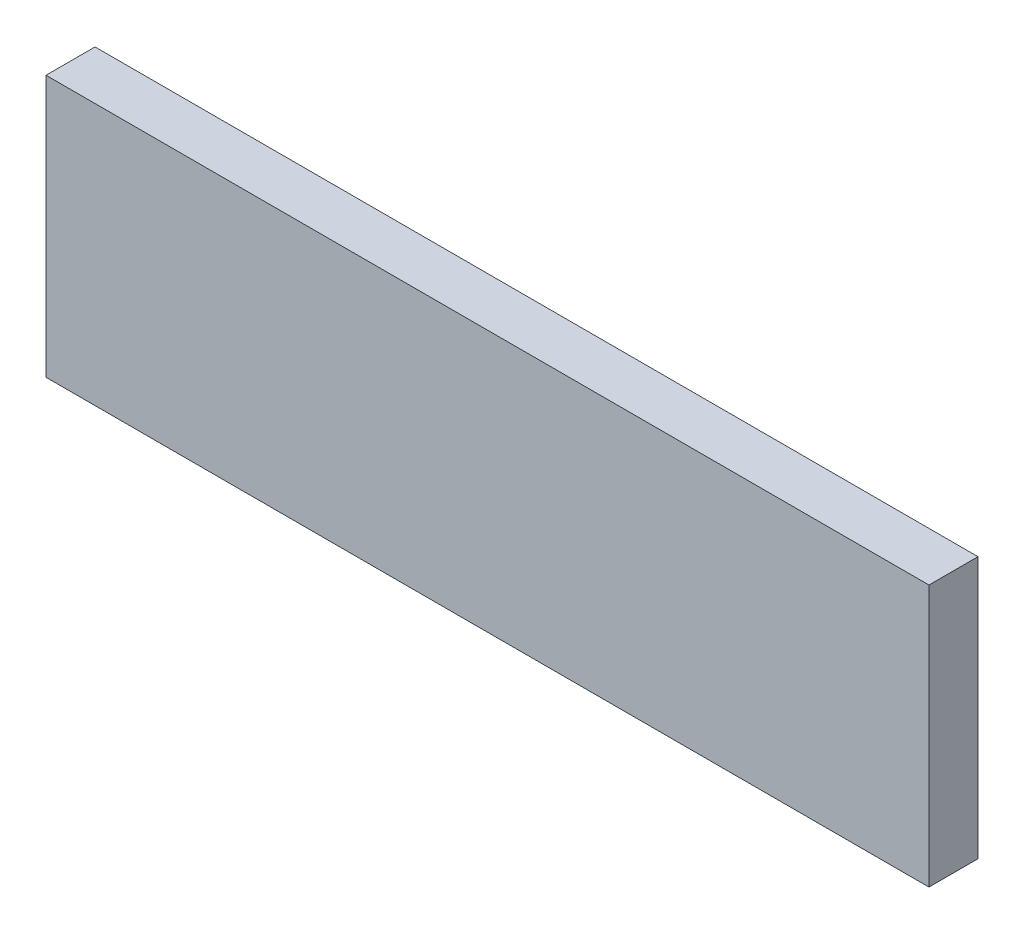
ISO-10303-21;
HEADER;
FILE_DESCRIPTION(('STEP AP214'),'2;1');
FILE_NAME('part.step','',(''),(''),'','','');
FILE_SCHEMA(('AUTOMOTIVE_DESIGN { 1 0 10303 214 1 1 1 1 }'));
ENDSEC;
DATA;
#1=APPLICATION_CONTEXT('core data for automotive mechanical design processes');
#2=APPLICATION_PROTOCOL_DEFINITION('international standard','automotive_design',2000,#1);
#3=PRODUCT_CONTEXT('',#1,'mechanical');
#4=PRODUCT('Part','Part','',(#3));
#5=PRODUCT_RELATED_PRODUCT_CATEGORY('part','',(#4));
#6=PRODUCT_DEFINITION_FORMATION('','',#4);
#7=PRODUCT_DEFINITION_CONTEXT('part definition',#1,'design');
#8=PRODUCT_DEFINITION('design','',#6,#7);
#9=PRODUCT_DEFINITION_SHAPE('','',#8);
#10=(LENGTH_UNIT() NAMED_UNIT(*) SI_UNIT(.MILLI.,.METRE.));
#11=(NAMED_UNIT(*) PLANE_ANGLE_UNIT() SI_UNIT($,.RADIAN.));
#12=(NAMED_UNIT(*) SI_UNIT($,.STERADIAN.) SOLID_ANGLE_UNIT());
#13=UNCERTAINTY_MEASURE_WITH_UNIT(LENGTH_MEASURE(1.E-05),#10,'distance_accuracy_value','');
#14=(GEOMETRIC_REPRESENTATION_CONTEXT(3) GLOBAL_UNCERTAINTY_ASSIGNED_CONTEXT((#13)) GLOBAL_UNIT_ASSIGNED_CONTEXT((#10,
#11,#12)) REPRESENTATION_CONTEXT('',''));
#15=CARTESIAN_POINT('',(0.,0.,0.));
#16=DIRECTION('',(0.,0.,1.));
#17=DIRECTION('',(1.,0.,0.));
#18=AXIS2_PLACEMENT_3D('',#15,#16,#17);
#19=CARTESIAN_POINT('',(-1.34999984,0.40000174,0.15));
#20=DIRECTION('',(0.,0.,1.));
#21=DIRECTION('',(1.,0.,0.));
#22=AXIS2_PLACEMENT_3D('',#19,#20,#21);
#23=PLANE('',#22);
#24=DIRECTION('',(0.,1.,0.));
#25=VECTOR('',#24,1.);
#26=CARTESIAN_POINT('',(1.34999984,0.40000174,0.15));
#27=LINE('',#26,#25);
#28=CARTESIAN_POINT('',(1.34999984,0.40000174,0.15));
#29=VERTEX_POINT('',#28);
#30=CARTESIAN_POINT('',(1.34999984,-0.3999992,0.15));
#31=VERTEX_POINT('',#30);
#32=EDGE_CURVE('E53',#29,#31,#27,.F.);
#33=ORIENTED_EDGE('',*,*,#32,.F.);
#34=DIRECTION('',(1.,0.,0.));
#35=VECTOR('',#34,1.);
#36=CARTESIAN_POINT('',(-1.34999984,0.40000174,0.15));
#37=LINE('',#36,#35);
#38=CARTESIAN_POINT('',(-1.34999984,0.40000174,0.15));
#39=VERTEX_POINT('',#38);
#40=EDGE_CURVE('E69',#39,#29,#37,.T.);
#41=ORIENTED_EDGE('',*,*,#40,.F.);
#42=DIRECTION('',(0.,1.,0.));
#43=VECTOR('',#42,1.);
#44=CARTESIAN_POINT('',(-1.34999984,-0.3999992,0.15));
#45=LINE('',#44,#43);
#46=CARTESIAN_POINT('',(-1.34999984,-0.3999992,0.15));
#47=VERTEX_POINT('',#46);
#48=EDGE_CURVE('E19',#47,#39,#45,.T.);
#49=ORIENTED_EDGE('',*,*,#48,.F.);
#50=DIRECTION('',(1.,0.,0.));
#51=VECTOR('',#50,1.);
#52=CARTESIAN_POINT('',(1.34999984,-0.3999992,0.15));
#53=LINE('',#52,#51);
#54=EDGE_CURVE('E58',#31,#47,#53,.F.);
#55=ORIENTED_EDGE('',*,*,#54,.F.);
#56=EDGE_LOOP('',(#33,#41,#49,#55));
#57=FACE_BOUND('',#56,.T.);
#58=ADVANCED_FACE('F16',(#57),#23,.T.);
#59=CARTESIAN_POINT('',(-1.34999984,-0.3999992,0.));
#60=DIRECTION('',(-1.,0.,0.));
#61=DIRECTION('',(0.,0.,1.));
#62=AXIS2_PLACEMENT_3D('',#59,#60,#61);
#63=PLANE('',#62);
#64=DIRECTION('',(0.,0.,1.));
#65=VECTOR('',#64,1.);
#66=CARTESIAN_POINT('',(-1.34999984,0.40000174,0.));
#67=LINE('',#66,#65);
#68=CARTESIAN_POINT('',(-1.34999984,0.40000174,0.));
#69=VERTEX_POINT('',#68);
#70=EDGE_CURVE('E88',#69,#39,#67,.T.);
#71=ORIENTED_EDGE('',*,*,#70,.F.);
#72=DIRECTION('',(0.,1.,0.));
#73=VECTOR('',#72,1.);
#74=CARTESIAN_POINT('',(-1.34999984,0.40000174,0.));
#75=LINE('',#74,#73);
#76=CARTESIAN_POINT('',(-1.34999984,-0.3999992,0.));
#77=VERTEX_POINT('',#76);
#78=EDGE_CURVE('E76',#69,#77,#75,.F.);
#79=ORIENTED_EDGE('',*,*,#78,.T.);
#80=DIRECTION('',(0.,0.,-1.));
#81=VECTOR('',#80,1.);
#82=CARTESIAN_POINT('',(-1.34999984,-0.3999992,0.));
#83=LINE('',#82,#81);
#84=EDGE_CURVE('E63',#47,#77,#83,.T.);
#85=ORIENTED_EDGE('',*,*,#84,.F.);
#86=ORIENTED_EDGE('',*,*,#48,.T.);
#87=EDGE_LOOP('',(#71,#79,#85,#86));
#88=FACE_BOUND('',#87,.T.);
#89=ADVANCED_FACE('F75',(#88),#63,.T.);
#90=CARTESIAN_POINT('',(1.34999984,-0.3999992,0.));
#91=DIRECTION('',(0.,-1.,0.));
#92=DIRECTION('',(0.,0.,-1.));
#93=AXIS2_PLACEMENT_3D('',#90,#91,#92);
#94=PLANE('',#93);
#95=ORIENTED_EDGE('',*,*,#84,.T.);
#96=DIRECTION('',(1.,0.,0.));
#97=VECTOR('',#96,1.);
#98=CARTESIAN_POINT('',(-1.34999984,-0.3999992,0.));
#99=LINE('',#98,#97);
#100=CARTESIAN_POINT('',(1.34999984,-0.3999992,0.));
#101=VERTEX_POINT('',#100);
#102=EDGE_CURVE('E96',#77,#101,#99,.T.);
#103=ORIENTED_EDGE('',*,*,#102,.T.);
#104=DIRECTION('',(0.,0.,-1.));
#105=VECTOR('',#104,1.);
#106=CARTESIAN_POINT('',(1.34999984,-0.3999992,0.));
#107=LINE('',#106,#105);
#108=EDGE_CURVE('E65',#31,#101,#107,.T.);
#109=ORIENTED_EDGE('',*,*,#108,.F.);
#110=ORIENTED_EDGE('',*,*,#54,.T.);
#111=EDGE_LOOP('',(#95,#103,#109,#110));
#112=FACE_BOUND('',#111,.T.);
#113=ADVANCED_FACE('F60',(#112),#94,.T.);
#114=CARTESIAN_POINT('',(1.34999984,0.40000174,0.));
#115=DIRECTION('',(1.,0.,0.));
#116=DIRECTION('',(0.,0.,-1.));
#117=AXIS2_PLACEMENT_3D('',#114,#115,#116);
#118=PLANE('',#117);
#119=ORIENTED_EDGE('',*,*,#108,.T.);
#120=DIRECTION('',(0.,1.,0.));
#121=VECTOR('',#120,1.);
#122=CARTESIAN_POINT('',(1.34999984,0.40000174,0.));
#123=LINE('',#122,#121);
#124=CARTESIAN_POINT('',(1.34999984,0.40000174,0.));
#125=VERTEX_POINT('',#124);
#126=EDGE_CURVE('E26',#101,#125,#123,.T.);
#127=ORIENTED_EDGE('',*,*,#126,.T.);
#128=DIRECTION('',(0.,0.,1.));
#129=VECTOR('',#128,1.);
#130=CARTESIAN_POINT('',(1.34999984,0.40000174,0.));
#131=LINE('',#130,#129);
#132=EDGE_CURVE('E34',#29,#125,#131,.F.);
#133=ORIENTED_EDGE('',*,*,#132,.F.);
#134=ORIENTED_EDGE('',*,*,#32,.T.);
#135=EDGE_LOOP('',(#119,#127,#133,#134));
#136=FACE_BOUND('',#135,.T.);
#137=ADVANCED_FACE('F102',(#136),#118,.T.);
#138=CARTESIAN_POINT('',(-1.34999984,0.40000174,0.));
#139=DIRECTION('',(0.,1.,0.));
#140=DIRECTION('',(0.,0.,1.));
#141=AXIS2_PLACEMENT_3D('',#138,#139,#140);
#142=PLANE('',#141);
#143=ORIENTED_EDGE('',*,*,#132,.T.);
#144=DIRECTION('',(1.,0.,0.));
#145=VECTOR('',#144,1.);
#146=CARTESIAN_POINT('',(-1.34999984,0.40000174,0.));
#147=LINE('',#146,#145);
#148=EDGE_CURVE('E11',#125,#69,#147,.F.);
#149=ORIENTED_EDGE('',*,*,#148,.T.);
#150=ORIENTED_EDGE('',*,*,#70,.T.);
#151=ORIENTED_EDGE('',*,*,#40,.T.);
#152=EDGE_LOOP('',(#143,#149,#150,#151));
#153=FACE_BOUND('',#152,.T.);
#154=ADVANCED_FACE('F105',(#153),#142,.T.);
#155=CARTESIAN_POINT('',(-1.34999984,0.40000174,0.));
#156=DIRECTION('',(0.,0.,1.));
#157=DIRECTION('',(1.,0.,0.));
#158=AXIS2_PLACEMENT_3D('',#155,#156,#157);
#159=PLANE('',#158);
#160=ORIENTED_EDGE('',*,*,#126,.F.);
#161=ORIENTED_EDGE('',*,*,#102,.F.);
#162=ORIENTED_EDGE('',*,*,#78,.F.);
#163=ORIENTED_EDGE('',*,*,#148,.F.);
#164=EDGE_LOOP('',(#160,#161,#162,#163));
#165=FACE_BOUND('',#164,.T.);
#166=ADVANCED_FACE('F104',(#165),#159,.F.);
#167=CLOSED_SHELL('',(#58,#89,#113,#137,#154,#166));
#168=MANIFOLD_SOLID_BREP('B1',#167);
#169=ADVANCED_BREP_SHAPE_REPRESENTATION('',(#18,#168),#14);
#170=SHAPE_DEFINITION_REPRESENTATION(#9,#169);
ENDSEC;
END-ISO-10303-21;
